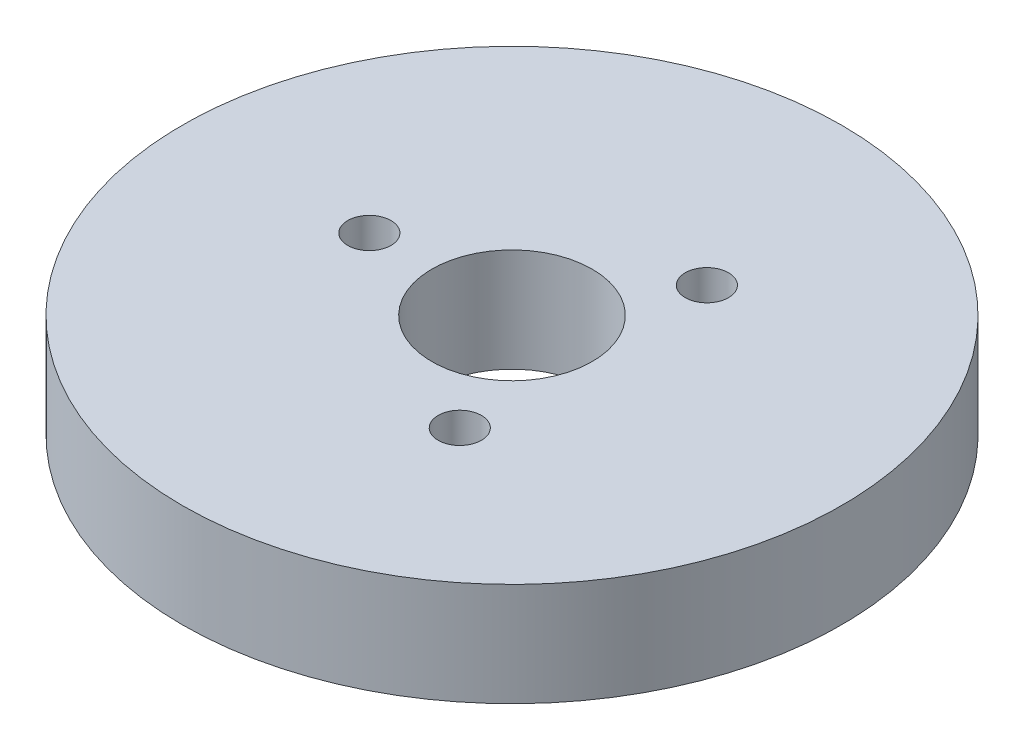
ISO-10303-21;
HEADER;
FILE_DESCRIPTION(('STEP AP214'),'2;1');
FILE_NAME('part.step','',(''),(''),'','','');
FILE_SCHEMA(('AUTOMOTIVE_DESIGN { 1 0 10303 214 1 1 1 1 }'));
ENDSEC;
DATA;
#1=APPLICATION_CONTEXT('core data for automotive mechanical design processes');
#2=APPLICATION_PROTOCOL_DEFINITION('international standard','automotive_design',2000,#1);
#3=PRODUCT_CONTEXT('',#1,'mechanical');
#4=PRODUCT('Part','Part','',(#3));
#5=PRODUCT_RELATED_PRODUCT_CATEGORY('part','',(#4));
#6=PRODUCT_DEFINITION_FORMATION('','',#4);
#7=PRODUCT_DEFINITION_CONTEXT('part definition',#1,'design');
#8=PRODUCT_DEFINITION('design','',#6,#7);
#9=PRODUCT_DEFINITION_SHAPE('','',#8);
#10=(LENGTH_UNIT() NAMED_UNIT(*) SI_UNIT(.MILLI.,.METRE.));
#11=(NAMED_UNIT(*) PLANE_ANGLE_UNIT() SI_UNIT($,.RADIAN.));
#12=(NAMED_UNIT(*) SI_UNIT($,.STERADIAN.) SOLID_ANGLE_UNIT());
#13=UNCERTAINTY_MEASURE_WITH_UNIT(LENGTH_MEASURE(1.E-05),#10,'distance_accuracy_value','');
#14=(GEOMETRIC_REPRESENTATION_CONTEXT(3) GLOBAL_UNCERTAINTY_ASSIGNED_CONTEXT((#13)) GLOBAL_UNIT_ASSIGNED_CONTEXT((#10,
#11,#12)) REPRESENTATION_CONTEXT('',''));
#15=CARTESIAN_POINT('',(0.,0.,0.));
#16=DIRECTION('',(0.,0.,1.));
#17=DIRECTION('',(1.,0.,0.));
#18=AXIS2_PLACEMENT_3D('',#15,#16,#17);
#19=CARTESIAN_POINT('',(0.,29.,0.));
#20=DIRECTION('',(0.,-1.,0.));
#21=DIRECTION('',(0.,0.,-1.));
#22=AXIS2_PLACEMENT_3D('',#19,#20,#21);
#23=CYLINDRICAL_SURFACE('',#22,92.5);
#24=CARTESIAN_POINT('',(0.,29.,0.));
#25=DIRECTION('',(0.,1.,0.));
#26=DIRECTION('',(0.,0.,1.));
#27=AXIS2_PLACEMENT_3D('',#24,#25,#26);
#28=CIRCLE('',#27,92.5);
#29=CARTESIAN_POINT('',(0.,29.,-92.5));
#30=VERTEX_POINT('',#29);
#31=EDGE_CURVE('E10',#30,#30,#28,.T.);
#32=CARTESIAN_POINT('',(0.,0.,0.));
#33=DIRECTION('',(0.,1.,0.));
#34=DIRECTION('',(0.,0.,1.));
#35=AXIS2_PLACEMENT_3D('',#32,#33,#34);
#36=CIRCLE('',#35,92.5);
#37=CARTESIAN_POINT('',(0.,0.,-92.5));
#38=VERTEX_POINT('',#37);
#39=EDGE_CURVE('E37',#38,#38,#36,.T.);
#40=CARTESIAN_POINT('',(0.,29.,-92.5));
#41=CARTESIAN_POINT('',(0.,28.6979166666667,-92.5));
#42=CARTESIAN_POINT('',(0.,28.3958333333333,-92.5));
#43=CARTESIAN_POINT('',(0.,27.7916666666667,-92.5));
#44=CARTESIAN_POINT('',(0.,27.4895833333333,-92.5));
#45=CARTESIAN_POINT('',(0.,26.8854166666667,-92.5));
#46=CARTESIAN_POINT('',(0.,26.5833333333333,-92.5));
#47=CARTESIAN_POINT('',(0.,25.9791666666667,-92.5));
#48=CARTESIAN_POINT('',(0.,25.6770833333333,-92.5));
#49=CARTESIAN_POINT('',(0.,25.0729166666667,-92.5));
#50=CARTESIAN_POINT('',(0.,24.7708333333333,-92.5));
#51=CARTESIAN_POINT('',(0.,24.1666666666667,-92.5));
#52=CARTESIAN_POINT('',(0.,23.8645833333333,-92.5));
#53=CARTESIAN_POINT('',(0.,23.2604166666667,-92.5));
#54=CARTESIAN_POINT('',(0.,22.9583333333333,-92.5));
#55=CARTESIAN_POINT('',(0.,22.3541666666667,-92.5));
#56=CARTESIAN_POINT('',(0.,22.0520833333333,-92.5));
#57=CARTESIAN_POINT('',(0.,21.4479166666667,-92.5));
#58=CARTESIAN_POINT('',(0.,21.1458333333333,-92.5));
#59=CARTESIAN_POINT('',(0.,20.5416666666667,-92.5));
#60=CARTESIAN_POINT('',(0.,20.2395833333333,-92.5));
#61=CARTESIAN_POINT('',(0.,19.6354166666667,-92.5));
#62=CARTESIAN_POINT('',(0.,19.3333333333333,-92.5));
#63=CARTESIAN_POINT('',(0.,18.7291666666667,-92.5));
#64=CARTESIAN_POINT('',(0.,18.4270833333333,-92.5));
#65=CARTESIAN_POINT('',(0.,17.8229166666667,-92.5));
#66=CARTESIAN_POINT('',(0.,17.5208333333333,-92.5));
#67=CARTESIAN_POINT('',(0.,16.9166666666667,-92.5));
#68=CARTESIAN_POINT('',(0.,16.6145833333333,-92.5));
#69=CARTESIAN_POINT('',(0.,16.0104166666667,-92.5));
#70=CARTESIAN_POINT('',(0.,15.7083333333333,-92.5));
#71=CARTESIAN_POINT('',(0.,15.1041666666667,-92.5));
#72=CARTESIAN_POINT('',(0.,14.8020833333333,-92.5));
#73=CARTESIAN_POINT('',(0.,14.1979166666667,-92.5));
#74=CARTESIAN_POINT('',(0.,13.8958333333333,-92.5));
#75=CARTESIAN_POINT('',(0.,13.2916666666667,-92.5));
#76=CARTESIAN_POINT('',(0.,12.9895833333333,-92.5));
#77=CARTESIAN_POINT('',(0.,12.3854166666667,-92.5));
#78=CARTESIAN_POINT('',(0.,12.0833333333333,-92.5));
#79=CARTESIAN_POINT('',(0.,11.4791666666667,-92.5));
#80=CARTESIAN_POINT('',(0.,11.1770833333333,-92.5));
#81=CARTESIAN_POINT('',(0.,10.5729166666667,-92.5));
#82=CARTESIAN_POINT('',(0.,10.2708333333333,-92.5));
#83=CARTESIAN_POINT('',(0.,9.66666666666667,-92.5));
#84=CARTESIAN_POINT('',(0.,9.36458333333333,-92.5));
#85=CARTESIAN_POINT('',(0.,8.76041666666667,-92.5));
#86=CARTESIAN_POINT('',(0.,8.45833333333333,-92.5));
#87=CARTESIAN_POINT('',(0.,7.85416666666667,-92.5));
#88=CARTESIAN_POINT('',(0.,7.55208333333333,-92.5));
#89=CARTESIAN_POINT('',(0.,6.94791666666667,-92.5));
#90=CARTESIAN_POINT('',(0.,6.64583333333333,-92.5));
#91=CARTESIAN_POINT('',(0.,6.04166666666667,-92.5));
#92=CARTESIAN_POINT('',(0.,5.73958333333333,-92.5));
#93=CARTESIAN_POINT('',(0.,5.13541666666667,-92.5));
#94=CARTESIAN_POINT('',(0.,4.83333333333333,-92.5));
#95=CARTESIAN_POINT('',(0.,4.22916666666667,-92.5));
#96=CARTESIAN_POINT('',(0.,3.92708333333333,-92.5));
#97=CARTESIAN_POINT('',(0.,3.32291666666667,-92.5));
#98=CARTESIAN_POINT('',(0.,3.02083333333333,-92.5));
#99=CARTESIAN_POINT('',(0.,2.41666666666667,-92.5));
#100=CARTESIAN_POINT('',(0.,2.11458333333333,-92.5));
#101=CARTESIAN_POINT('',(0.,1.51041666666667,-92.5));
#102=CARTESIAN_POINT('',(0.,1.20833333333333,-92.5));
#103=CARTESIAN_POINT('',(0.,0.604166666666667,-92.5));
#104=CARTESIAN_POINT('',(0.,0.302083333333333,-92.5));
#105=CARTESIAN_POINT('',(0.,0.,-92.5));
#106=B_SPLINE_CURVE_WITH_KNOTS('',3,(#40,#41,#42,#43,#44,#45,#46,#47,#48,#49,#50,#51,#52,#53,
#54,#55,#56,#57,#58,#59,#60,#61,#62,#63,#64,#65,#66,#67,#68,#69,#70,#71,#72,#73,#74,#75,#76,#77,
#78,#79,#80,#81,#82,#83,#84,#85,#86,#87,#88,#89,#90,#91,#92,#93,#94,#95,#96,#97,#98,#99,#100,
#101,#102,#103,#104,#105),.UNSPECIFIED.,.F.,.F.,(4,2,2,2,2,2,2,2,2,2,2,2,2,2,2,2,2,2,2,2,2,2,2,
2,2,2,2,2,2,2,2,2,4),(0.,0.906249999999997,1.8125,2.71875,3.625,4.53125,5.4375,6.34375,7.25,
8.15625,9.0625,9.96875,10.875,11.78125,12.6875,13.59375,14.5,15.40625,16.3125,17.21875,18.125,
19.03125,19.9375,20.84375,21.75,22.65625,23.5625,24.46875,25.375,26.28125,27.1875,28.09375,29.),.UNSPECIFIED.);
#107=EDGE_CURVE('BSEAM40',#30,#38,#106,.T.);
#108=ORIENTED_EDGE('',*,*,#31,.F.);
#109=ORIENTED_EDGE('',*,*,#39,.T.);
#110=ORIENTED_EDGE('',*,*,#107,.T.);
#111=ORIENTED_EDGE('',*,*,#107,.F.);
#112=EDGE_LOOP('',(#108,#110,#109,#111));
#113=FACE_BOUND('',#112,.T.);
#114=ADVANCED_FACE('F40',(#113),#23,.T.);
#115=CARTESIAN_POINT('',(0.,29.,0.));
#116=DIRECTION('',(0.,1.,0.));
#117=DIRECTION('',(0.,0.,1.));
#118=AXIS2_PLACEMENT_3D('',#115,#116,#117);
#119=PLANE('',#118);
#120=CARTESIAN_POINT('',(20.0194101079849,29.,34.6746354445875));
#121=DIRECTION('',(0.,1.,0.));
#122=DIRECTION('',(0.866025403784436,0.,-0.500000000000004));
#123=AXIS2_PLACEMENT_3D('',#120,#121,#122);
#124=CIRCLE('',#123,6.07092114000152);
#125=CARTESIAN_POINT('',(25.2769820395982,29.,31.6391748745867));
#126=VERTEX_POINT('',#125);
#127=EDGE_CURVE('E70',#126,#126,#124,.T.);
#128=ORIENTED_EDGE('',*,*,#127,.F.);
#129=EDGE_LOOP('',(#128));
#130=FACE_BOUND('',#129,.T.);
#131=CARTESIAN_POINT('',(20.0194101079845,29.,-34.6746354445878));
#132=DIRECTION('',(0.,1.,0.));
#133=DIRECTION('',(-0.866025403784443,0.,-0.499999999999992));
#134=AXIS2_PLACEMENT_3D('',#131,#132,#133);
#135=CIRCLE('',#134,6.07092114000152);
#136=CARTESIAN_POINT('',(14.7618381763711,29.,-37.7100960145885));
#137=VERTEX_POINT('',#136);
#138=EDGE_CURVE('E61',#137,#137,#135,.T.);
#139=ORIENTED_EDGE('',*,*,#138,.F.);
#140=EDGE_LOOP('',(#139));
#141=FACE_BOUND('',#140,.T.);
#142=CARTESIAN_POINT('',(-40.0388202159696,29.,0.));
#143=DIRECTION('',(0.,1.,0.));
#144=DIRECTION('',(0.,0.,1.));
#145=AXIS2_PLACEMENT_3D('',#142,#143,#144);
#146=CIRCLE('',#145,6.07092114000152);
#147=CARTESIAN_POINT('',(-40.0388202159696,29.,6.07092114000152));
#148=VERTEX_POINT('',#147);
#149=EDGE_CURVE('E54',#148,#148,#146,.T.);
#150=ORIENTED_EDGE('',*,*,#149,.F.);
#151=EDGE_LOOP('',(#150));
#152=FACE_BOUND('',#151,.T.);
#153=CARTESIAN_POINT('',(0.,29.,0.));
#154=DIRECTION('',(0.,1.,0.));
#155=DIRECTION('',(0.,0.,1.));
#156=AXIS2_PLACEMENT_3D('',#153,#154,#155);
#157=CIRCLE('',#156,22.5);
#158=CARTESIAN_POINT('',(0.,29.,-22.5));
#159=VERTEX_POINT('',#158);
#160=EDGE_CURVE('E50',#159,#159,#157,.T.);
#161=ORIENTED_EDGE('',*,*,#160,.F.);
#162=EDGE_LOOP('',(#161));
#163=FACE_BOUND('',#162,.T.);
#164=ORIENTED_EDGE('',*,*,#31,.T.);
#165=EDGE_LOOP('',(#164));
#166=FACE_BOUND('',#165,.T.);
#167=ADVANCED_FACE('F85',(#130,#141,#152,#163,#166),#119,.T.);
#168=CARTESIAN_POINT('',(0.,0.,0.));
#169=DIRECTION('',(0.,1.,0.));
#170=DIRECTION('',(0.,0.,1.));
#171=AXIS2_PLACEMENT_3D('',#168,#169,#170);
#172=PLANE('',#171);
#173=CARTESIAN_POINT('',(0.,0.,0.));
#174=DIRECTION('',(0.,1.,0.));
#175=DIRECTION('',(0.,0.,1.));
#176=AXIS2_PLACEMENT_3D('',#173,#174,#175);
#177=CIRCLE('',#176,22.5);
#178=CARTESIAN_POINT('',(0.,0.,-22.5));
#179=VERTEX_POINT('',#178);
#180=EDGE_CURVE('E47',#179,#179,#177,.T.);
#181=ORIENTED_EDGE('',*,*,#180,.T.);
#182=EDGE_LOOP('',(#181));
#183=FACE_BOUND('',#182,.T.);
#184=ORIENTED_EDGE('',*,*,#39,.F.);
#185=EDGE_LOOP('',(#184));
#186=FACE_BOUND('',#185,.T.);
#187=ADVANCED_FACE('F84',(#183,#186),#172,.F.);
#188=CARTESIAN_POINT('',(0.,29.,0.));
#189=DIRECTION('',(0.,-1.,0.));
#190=DIRECTION('',(0.,0.,-1.));
#191=AXIS2_PLACEMENT_3D('',#188,#189,#190);
#192=CYLINDRICAL_SURFACE('',#191,22.5);
#193=CARTESIAN_POINT('',(0.,29.,-22.5));
#194=CARTESIAN_POINT('',(0.,28.6979166666667,-22.5));
#195=CARTESIAN_POINT('',(0.,28.3958333333333,-22.5));
#196=CARTESIAN_POINT('',(0.,27.7916666666667,-22.5));
#197=CARTESIAN_POINT('',(0.,27.4895833333333,-22.5));
#198=CARTESIAN_POINT('',(0.,26.8854166666667,-22.5));
#199=CARTESIAN_POINT('',(0.,26.5833333333333,-22.5));
#200=CARTESIAN_POINT('',(0.,25.9791666666667,-22.5));
#201=CARTESIAN_POINT('',(0.,25.6770833333333,-22.5));
#202=CARTESIAN_POINT('',(0.,25.0729166666667,-22.5));
#203=CARTESIAN_POINT('',(0.,24.7708333333333,-22.5));
#204=CARTESIAN_POINT('',(0.,24.1666666666667,-22.5));
#205=CARTESIAN_POINT('',(0.,23.8645833333333,-22.5));
#206=CARTESIAN_POINT('',(0.,23.2604166666667,-22.5));
#207=CARTESIAN_POINT('',(0.,22.9583333333333,-22.5));
#208=CARTESIAN_POINT('',(0.,22.3541666666667,-22.5));
#209=CARTESIAN_POINT('',(0.,22.0520833333333,-22.5));
#210=CARTESIAN_POINT('',(0.,21.4479166666667,-22.5));
#211=CARTESIAN_POINT('',(0.,21.1458333333333,-22.5));
#212=CARTESIAN_POINT('',(0.,20.5416666666667,-22.5));
#213=CARTESIAN_POINT('',(0.,20.2395833333333,-22.5));
#214=CARTESIAN_POINT('',(0.,19.6354166666667,-22.5));
#215=CARTESIAN_POINT('',(0.,19.3333333333333,-22.5));
#216=CARTESIAN_POINT('',(0.,18.7291666666667,-22.5));
#217=CARTESIAN_POINT('',(0.,18.4270833333333,-22.5));
#218=CARTESIAN_POINT('',(0.,17.8229166666667,-22.5));
#219=CARTESIAN_POINT('',(0.,17.5208333333333,-22.5));
#220=CARTESIAN_POINT('',(0.,16.9166666666667,-22.5));
#221=CARTESIAN_POINT('',(0.,16.6145833333333,-22.5));
#222=CARTESIAN_POINT('',(0.,16.0104166666667,-22.5));
#223=CARTESIAN_POINT('',(0.,15.7083333333333,-22.5));
#224=CARTESIAN_POINT('',(0.,15.1041666666667,-22.5));
#225=CARTESIAN_POINT('',(0.,14.8020833333333,-22.5));
#226=CARTESIAN_POINT('',(0.,14.1979166666667,-22.5));
#227=CARTESIAN_POINT('',(0.,13.8958333333333,-22.5));
#228=CARTESIAN_POINT('',(0.,13.2916666666667,-22.5));
#229=CARTESIAN_POINT('',(0.,12.9895833333333,-22.5));
#230=CARTESIAN_POINT('',(0.,12.3854166666667,-22.5));
#231=CARTESIAN_POINT('',(0.,12.0833333333333,-22.5));
#232=CARTESIAN_POINT('',(0.,11.4791666666667,-22.5));
#233=CARTESIAN_POINT('',(0.,11.1770833333333,-22.5));
#234=CARTESIAN_POINT('',(0.,10.5729166666667,-22.5));
#235=CARTESIAN_POINT('',(0.,10.2708333333333,-22.5));
#236=CARTESIAN_POINT('',(0.,9.66666666666667,-22.5));
#237=CARTESIAN_POINT('',(0.,9.36458333333333,-22.5));
#238=CARTESIAN_POINT('',(0.,8.76041666666667,-22.5));
#239=CARTESIAN_POINT('',(0.,8.45833333333333,-22.5));
#240=CARTESIAN_POINT('',(0.,7.85416666666667,-22.5));
#241=CARTESIAN_POINT('',(0.,7.55208333333333,-22.5));
#242=CARTESIAN_POINT('',(0.,6.94791666666667,-22.5));
#243=CARTESIAN_POINT('',(0.,6.64583333333333,-22.5));
#244=CARTESIAN_POINT('',(0.,6.04166666666667,-22.5));
#245=CARTESIAN_POINT('',(0.,5.73958333333333,-22.5));
#246=CARTESIAN_POINT('',(0.,5.13541666666667,-22.5));
#247=CARTESIAN_POINT('',(0.,4.83333333333333,-22.5));
#248=CARTESIAN_POINT('',(0.,4.22916666666667,-22.5));
#249=CARTESIAN_POINT('',(0.,3.92708333333333,-22.5));
#250=CARTESIAN_POINT('',(0.,3.32291666666667,-22.5));
#251=CARTESIAN_POINT('',(0.,3.02083333333333,-22.5));
#252=CARTESIAN_POINT('',(0.,2.41666666666667,-22.5));
#253=CARTESIAN_POINT('',(0.,2.11458333333333,-22.5));
#254=CARTESIAN_POINT('',(0.,1.51041666666667,-22.5));
#255=CARTESIAN_POINT('',(0.,1.20833333333333,-22.5));
#256=CARTESIAN_POINT('',(0.,0.604166666666667,-22.5));
#257=CARTESIAN_POINT('',(0.,0.302083333333333,-22.5));
#258=CARTESIAN_POINT('',(0.,0.,-22.5));
#259=B_SPLINE_CURVE_WITH_KNOTS('',3,(#193,#194,#195,#196,#197,#198,#199,#200,#201,#202,#203,
#204,#205,#206,#207,#208,#209,#210,#211,#212,#213,#214,#215,#216,#217,#218,#219,#220,#221,#222,
#223,#224,#225,#226,#227,#228,#229,#230,#231,#232,#233,#234,#235,#236,#237,#238,#239,#240,#241,
#242,#243,#244,#245,#246,#247,#248,#249,#250,#251,#252,#253,#254,#255,#256,#257,#258),
.UNSPECIFIED.,.F.,.F.,(4,2,2,2,2,2,2,2,2,2,2,2,2,2,2,2,2,2,2,2,2,2,2,2,2,2,2,2,2,2,2,2,4),(0.,
0.906249999999997,1.8125,2.71875,3.625,4.53125,5.4375,6.34375,7.25,8.15625,9.0625,9.96875,
10.875,11.78125,12.6875,13.59375,14.5,15.40625,16.3125,17.21875,18.125,19.03125,19.9375,
20.84375,21.75,22.65625,23.5625,24.46875,25.375,26.28125,27.1875,28.09375,29.),.UNSPECIFIED.);
#260=EDGE_CURVE('BSEAM91',#159,#179,#259,.T.);
#261=ORIENTED_EDGE('',*,*,#160,.T.);
#262=ORIENTED_EDGE('',*,*,#180,.F.);
#263=ORIENTED_EDGE('',*,*,#260,.T.);
#264=ORIENTED_EDGE('',*,*,#260,.F.);
#265=EDGE_LOOP('',(#261,#263,#262,#264));
#266=FACE_BOUND('',#265,.T.);
#267=ADVANCED_FACE('F91',(#266),#192,.F.);
#268=CARTESIAN_POINT('',(-40.0388202159696,9.45600103356817,0.));
#269=DIRECTION('',(0.,1.,0.));
#270=DIRECTION('',(0.,0.,1.));
#271=AXIS2_PLACEMENT_3D('',#268,#269,#270);
#272=CYLINDRICAL_SURFACE('',#271,6.07092114000152);
#273=CARTESIAN_POINT('',(-40.0388202159696,9.45600103356817,0.));
#274=DIRECTION('',(0.,1.,0.));
#275=DIRECTION('',(0.,0.,1.));
#276=AXIS2_PLACEMENT_3D('',#273,#274,#275);
#277=CIRCLE('',#276,6.07092114000152);
#278=CARTESIAN_POINT('',(-40.0388202159696,9.45600103356817,6.07092114000152));
#279=VERTEX_POINT('',#278);
#280=EDGE_CURVE('E55',#279,#279,#277,.T.);
#281=ORIENTED_EDGE('',*,*,#280,.F.);
#282=EDGE_LOOP('',(#281));
#283=FACE_BOUND('',#282,.T.);
#284=ORIENTED_EDGE('',*,*,#149,.T.);
#285=EDGE_LOOP('',(#284));
#286=FACE_BOUND('',#285,.T.);
#287=ADVANCED_FACE('F96',(#283,#286),#272,.F.);
#288=CARTESIAN_POINT('',(-40.0388202159696,9.45600103356817,0.));
#289=DIRECTION('',(0.,1.,0.));
#290=DIRECTION('',(0.,0.,1.));
#291=AXIS2_PLACEMENT_3D('',#288,#289,#290);
#292=PLANE('',#291);
#293=ORIENTED_EDGE('',*,*,#280,.T.);
#294=EDGE_LOOP('',(#293));
#295=FACE_BOUND('',#294,.T.);
#296=ADVANCED_FACE('F127',(#295),#292,.T.);
#297=CARTESIAN_POINT('',(20.0194101079845,9.45600103356817,-34.6746354445878));
#298=DIRECTION('',(0.,1.,0.));
#299=DIRECTION('',(0.,0.,1.));
#300=AXIS2_PLACEMENT_3D('',#297,#298,#299);
#301=CYLINDRICAL_SURFACE('',#300,6.07092114000152);
#302=CARTESIAN_POINT('',(20.0194101079845,9.45600103356817,-34.6746354445878));
#303=DIRECTION('',(0.,1.,0.));
#304=DIRECTION('',(-0.866025403784443,0.,-0.499999999999992));
#305=AXIS2_PLACEMENT_3D('',#302,#303,#304);
#306=CIRCLE('',#305,6.07092114000152);
#307=CARTESIAN_POINT('',(14.7618381763711,9.45600103356817,-37.7100960145885));
#308=VERTEX_POINT('',#307);
#309=EDGE_CURVE('E63',#308,#308,#306,.T.);
#310=ORIENTED_EDGE('',*,*,#309,.F.);
#311=EDGE_LOOP('',(#310));
#312=FACE_BOUND('',#311,.T.);
#313=ORIENTED_EDGE('',*,*,#138,.T.);
#314=EDGE_LOOP('',(#313));
#315=FACE_BOUND('',#314,.T.);
#316=ADVANCED_FACE('F133',(#312,#315),#301,.F.);
#317=CARTESIAN_POINT('',(20.0194101079845,9.45600103356817,-34.6746354445878));
#318=DIRECTION('',(0.,1.,0.));
#319=DIRECTION('',(-0.866025403784443,0.,-0.499999999999992));
#320=AXIS2_PLACEMENT_3D('',#317,#318,#319);
#321=PLANE('',#320);
#322=ORIENTED_EDGE('',*,*,#309,.T.);
#323=EDGE_LOOP('',(#322));
#324=FACE_BOUND('',#323,.T.);
#325=ADVANCED_FACE('F77',(#324),#321,.T.);
#326=CARTESIAN_POINT('',(20.0194101079849,9.45600103356817,34.6746354445875));
#327=DIRECTION('',(0.,1.,0.));
#328=DIRECTION('',(0.,0.,1.));
#329=AXIS2_PLACEMENT_3D('',#326,#327,#328);
#330=CYLINDRICAL_SURFACE('',#329,6.07092114000152);
#331=CARTESIAN_POINT('',(20.0194101079849,9.45600103356817,34.6746354445875));
#332=DIRECTION('',(0.,1.,0.));
#333=DIRECTION('',(0.866025403784436,0.,-0.500000000000004));
#334=AXIS2_PLACEMENT_3D('',#331,#332,#333);
#335=CIRCLE('',#334,6.07092114000152);
#336=CARTESIAN_POINT('',(25.2769820395982,9.45600103356817,31.6391748745867));
#337=VERTEX_POINT('',#336);
#338=EDGE_CURVE('E59',#337,#337,#335,.T.);
#339=ORIENTED_EDGE('',*,*,#338,.F.);
#340=EDGE_LOOP('',(#339));
#341=FACE_BOUND('',#340,.T.);
#342=ORIENTED_EDGE('',*,*,#127,.T.);
#343=EDGE_LOOP('',(#342));
#344=FACE_BOUND('',#343,.T.);
#345=ADVANCED_FACE('F73',(#341,#344),#330,.F.);
#346=CARTESIAN_POINT('',(20.0194101079849,9.45600103356817,34.6746354445875));
#347=DIRECTION('',(0.,1.,0.));
#348=DIRECTION('',(0.866025403784436,0.,-0.500000000000004));
#349=AXIS2_PLACEMENT_3D('',#346,#347,#348);
#350=PLANE('',#349);
#351=ORIENTED_EDGE('',*,*,#338,.T.);
#352=EDGE_LOOP('',(#351));
#353=FACE_BOUND('',#352,.T.);
#354=ADVANCED_FACE('F71',(#353),#350,.T.);
#355=CLOSED_SHELL('',(#114,#167,#187,#267,#287,#296,#316,#325,#345,#354));
#356=MANIFOLD_SOLID_BREP('B2',#355);
#357=ADVANCED_BREP_SHAPE_REPRESENTATION('',(#18,#356),#14);
#358=SHAPE_DEFINITION_REPRESENTATION(#9,#357);
ENDSEC;
END-ISO-10303-21;
